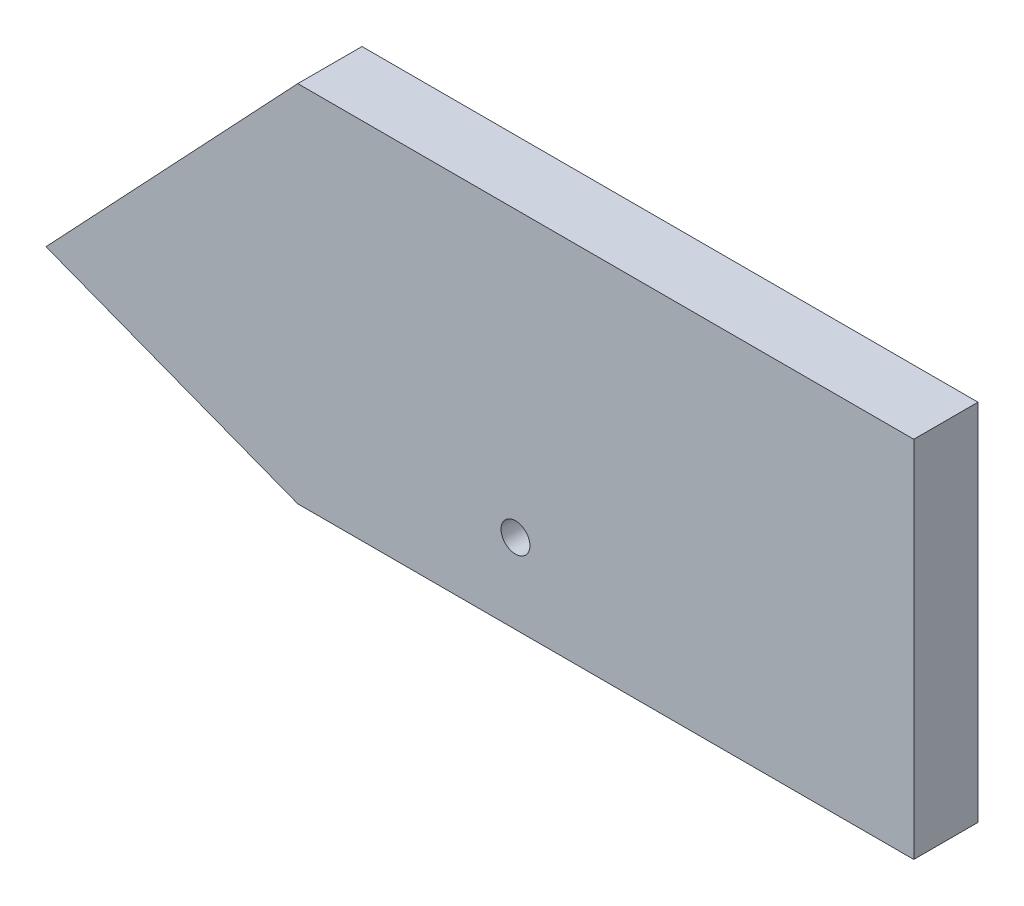
ISO-10303-21;
HEADER;
FILE_DESCRIPTION(('STEP AP214'),'2;1');
FILE_NAME('part.step','',(''),(''),'','','');
FILE_SCHEMA(('AUTOMOTIVE_DESIGN { 1 0 10303 214 1 1 1 1 }'));
ENDSEC;
DATA;
#1=APPLICATION_CONTEXT('core data for automotive mechanical design processes');
#2=APPLICATION_PROTOCOL_DEFINITION('international standard','automotive_design',2000,#1);
#3=PRODUCT_CONTEXT('',#1,'mechanical');
#4=PRODUCT('Part','Part','',(#3));
#5=PRODUCT_RELATED_PRODUCT_CATEGORY('part','',(#4));
#6=PRODUCT_DEFINITION_FORMATION('','',#4);
#7=PRODUCT_DEFINITION_CONTEXT('part definition',#1,'design');
#8=PRODUCT_DEFINITION('design','',#6,#7);
#9=PRODUCT_DEFINITION_SHAPE('','',#8);
#10=(LENGTH_UNIT() NAMED_UNIT(*) SI_UNIT(.MILLI.,.METRE.));
#11=(NAMED_UNIT(*) PLANE_ANGLE_UNIT() SI_UNIT($,.RADIAN.));
#12=(NAMED_UNIT(*) SI_UNIT($,.STERADIAN.) SOLID_ANGLE_UNIT());
#13=UNCERTAINTY_MEASURE_WITH_UNIT(LENGTH_MEASURE(1.E-05),#10,'distance_accuracy_value','');
#14=(GEOMETRIC_REPRESENTATION_CONTEXT(3) GLOBAL_UNCERTAINTY_ASSIGNED_CONTEXT((#13)) GLOBAL_UNIT_ASSIGNED_CONTEXT((#10,
#11,#12)) REPRESENTATION_CONTEXT('',''));
#15=CARTESIAN_POINT('',(0.,0.,0.));
#16=DIRECTION('',(0.,0.,1.));
#17=DIRECTION('',(1.,0.,0.));
#18=AXIS2_PLACEMENT_3D('',#15,#16,#17);
#19=CARTESIAN_POINT('',(-460.979412648812,-194.929034047607,10.));
#20=DIRECTION('',(-1.,0.,0.));
#21=DIRECTION('',(0.,0.,1.));
#22=AXIS2_PLACEMENT_3D('',#19,#20,#21);
#23=PLANE('',#22);
#24=DIRECTION('',(0.,1.,0.));
#25=VECTOR('',#24,1.);
#26=CARTESIAN_POINT('',(-460.979412648812,-194.929034047607,0.));
#27=LINE('',#26,#25);
#28=CARTESIAN_POINT('',(-460.979412648812,-194.929034047607,0.));
#29=VERTEX_POINT('',#28);
#30=CARTESIAN_POINT('',(-460.979412648812,-138.268279633482,0.));
#31=VERTEX_POINT('',#30);
#32=EDGE_CURVE('E109',#29,#31,#27,.T.);
#33=ORIENTED_EDGE('',*,*,#32,.T.);
#34=DIRECTION('',(0.,0.,-1.));
#35=VECTOR('',#34,1.);
#36=CARTESIAN_POINT('',(-460.979412648812,-138.268279633482,10.));
#37=LINE('',#36,#35);
#38=CARTESIAN_POINT('',(-460.979412648812,-138.268279633482,10.));
#39=VERTEX_POINT('',#38);
#40=EDGE_CURVE('E11',#39,#31,#37,.T.);
#41=ORIENTED_EDGE('',*,*,#40,.F.);
#42=DIRECTION('',(0.,1.,0.));
#43=VECTOR('',#42,1.);
#44=CARTESIAN_POINT('',(-460.979412648812,-194.929034047607,10.));
#45=LINE('',#44,#43);
#46=CARTESIAN_POINT('',(-460.979412648812,-194.929034047607,10.));
#47=VERTEX_POINT('',#46);
#48=EDGE_CURVE('E118',#47,#39,#45,.T.);
#49=ORIENTED_EDGE('',*,*,#48,.F.);
#50=DIRECTION('',(0.,0.,-1.));
#51=VECTOR('',#50,1.);
#52=CARTESIAN_POINT('',(-460.979412648812,-194.929034047607,10.));
#53=LINE('',#52,#51);
#54=EDGE_CURVE('E105',#47,#29,#53,.T.);
#55=ORIENTED_EDGE('',*,*,#54,.T.);
#56=EDGE_LOOP('',(#33,#41,#49,#55));
#57=FACE_BOUND('',#56,.T.);
#58=ADVANCED_FACE('F35',(#57),#23,.F.);
#59=CARTESIAN_POINT('',(-460.979412648812,-138.268279633482,10.));
#60=DIRECTION('',(0.,-1.,0.));
#61=DIRECTION('',(0.,0.,-1.));
#62=AXIS2_PLACEMENT_3D('',#59,#60,#61);
#63=PLANE('',#62);
#64=DIRECTION('',(-1.,0.,0.));
#65=VECTOR('',#64,1.);
#66=CARTESIAN_POINT('',(-460.979412648812,-138.268279633482,0.));
#67=LINE('',#66,#65);
#68=CARTESIAN_POINT('',(-556.886836404831,-138.268279633482,0.));
#69=VERTEX_POINT('',#68);
#70=EDGE_CURVE('E112',#31,#69,#67,.T.);
#71=ORIENTED_EDGE('',*,*,#70,.T.);
#72=DIRECTION('',(0.,0.,-1.));
#73=VECTOR('',#72,1.);
#74=CARTESIAN_POINT('',(-556.886836404831,-138.268279633482,10.));
#75=LINE('',#74,#73);
#76=CARTESIAN_POINT('',(-556.886836404831,-138.268279633482,10.));
#77=VERTEX_POINT('',#76);
#78=EDGE_CURVE('E43',#77,#69,#75,.T.);
#79=ORIENTED_EDGE('',*,*,#78,.F.);
#80=DIRECTION('',(-1.,0.,0.));
#81=VECTOR('',#80,1.);
#82=CARTESIAN_POINT('',(-460.979412648812,-138.268279633482,10.));
#83=LINE('',#82,#81);
#84=EDGE_CURVE('E85',#39,#77,#83,.T.);
#85=ORIENTED_EDGE('',*,*,#84,.F.);
#86=ORIENTED_EDGE('',*,*,#40,.T.);
#87=EDGE_LOOP('',(#71,#79,#85,#86));
#88=FACE_BOUND('',#87,.T.);
#89=ADVANCED_FACE('F138',(#88),#63,.F.);
#90=CARTESIAN_POINT('',(-556.886836404831,-138.268279633482,10.));
#91=DIRECTION('',(0.727697954606059,-0.68589772332481,0.));
#92=DIRECTION('',(0.68589772332481,0.727697954606059,0.));
#93=AXIS2_PLACEMENT_3D('',#90,#91,#92);
#94=PLANE('',#93);
#95=DIRECTION('',(-0.68589772332481,-0.727697954606059,0.));
#96=VECTOR('',#95,1.);
#97=CARTESIAN_POINT('',(-556.886836404831,-138.268279633482,0.));
#98=LINE('',#97,#96);
#99=CARTESIAN_POINT('',(-596.082218436845,-179.852321050678,0.));
#100=VERTEX_POINT('',#99);
#101=EDGE_CURVE('E100',#69,#100,#98,.T.);
#102=ORIENTED_EDGE('',*,*,#101,.T.);
#103=DIRECTION('',(0.,0.,-1.));
#104=VECTOR('',#103,1.);
#105=CARTESIAN_POINT('',(-596.082218436845,-179.852321050678,10.));
#106=LINE('',#105,#104);
#107=CARTESIAN_POINT('',(-596.082218436845,-179.852321050678,10.));
#108=VERTEX_POINT('',#107);
#109=EDGE_CURVE('E97',#108,#100,#106,.T.);
#110=ORIENTED_EDGE('',*,*,#109,.F.);
#111=DIRECTION('',(-0.68589772332481,-0.727697954606059,0.));
#112=VECTOR('',#111,1.);
#113=CARTESIAN_POINT('',(-556.886836404831,-138.268279633482,10.));
#114=LINE('',#113,#112);
#115=EDGE_CURVE('E89',#77,#108,#114,.T.);
#116=ORIENTED_EDGE('',*,*,#115,.F.);
#117=ORIENTED_EDGE('',*,*,#78,.T.);
#118=EDGE_LOOP('',(#102,#110,#116,#117));
#119=FACE_BOUND('',#118,.T.);
#120=ADVANCED_FACE('F98',(#119),#94,.F.);
#121=CARTESIAN_POINT('',(-596.082218436845,-179.852321050678,10.));
#122=DIRECTION('',(0.359011565041303,0.933333111041601,0.));
#123=DIRECTION('',(-0.933333111041601,0.359011565041303,0.));
#124=AXIS2_PLACEMENT_3D('',#121,#122,#123);
#125=PLANE('',#124);
#126=DIRECTION('',(0.933333111041601,-0.359011565041303,0.));
#127=VECTOR('',#126,1.);
#128=CARTESIAN_POINT('',(-596.082218436845,-179.852321050678,0.));
#129=LINE('',#128,#127);
#130=CARTESIAN_POINT('',(-556.886836404831,-194.929034047607,0.));
#131=VERTEX_POINT('',#130);
#132=EDGE_CURVE('E71',#100,#131,#129,.T.);
#133=ORIENTED_EDGE('',*,*,#132,.T.);
#134=DIRECTION('',(0.,0.,-1.));
#135=VECTOR('',#134,1.);
#136=CARTESIAN_POINT('',(-556.886836404831,-194.929034047607,10.));
#137=LINE('',#136,#135);
#138=CARTESIAN_POINT('',(-556.886836404831,-194.929034047607,10.));
#139=VERTEX_POINT('',#138);
#140=EDGE_CURVE('E101',#139,#131,#137,.T.);
#141=ORIENTED_EDGE('',*,*,#140,.F.);
#142=DIRECTION('',(0.933333111041601,-0.359011565041303,0.));
#143=VECTOR('',#142,1.);
#144=CARTESIAN_POINT('',(-596.082218436845,-179.852321050678,10.));
#145=LINE('',#144,#143);
#146=EDGE_CURVE('E93',#108,#139,#145,.T.);
#147=ORIENTED_EDGE('',*,*,#146,.F.);
#148=ORIENTED_EDGE('',*,*,#109,.T.);
#149=EDGE_LOOP('',(#133,#141,#147,#148));
#150=FACE_BOUND('',#149,.T.);
#151=ADVANCED_FACE('F103',(#150),#125,.F.);
#152=CARTESIAN_POINT('',(-556.886836404831,-194.929034047607,10.));
#153=DIRECTION('',(0.,1.,0.));
#154=DIRECTION('',(0.,0.,1.));
#155=AXIS2_PLACEMENT_3D('',#152,#153,#154);
#156=PLANE('',#155);
#157=DIRECTION('',(1.,0.,0.));
#158=VECTOR('',#157,1.);
#159=CARTESIAN_POINT('',(-556.886836404831,-194.929034047607,0.));
#160=LINE('',#159,#158);
#161=EDGE_CURVE('E77',#131,#29,#160,.T.);
#162=ORIENTED_EDGE('',*,*,#161,.T.);
#163=ORIENTED_EDGE('',*,*,#54,.F.);
#164=DIRECTION('',(1.,0.,0.));
#165=VECTOR('',#164,1.);
#166=CARTESIAN_POINT('',(-556.886836404831,-194.929034047607,10.));
#167=LINE('',#166,#165);
#168=EDGE_CURVE('E51',#139,#47,#167,.T.);
#169=ORIENTED_EDGE('',*,*,#168,.F.);
#170=ORIENTED_EDGE('',*,*,#140,.T.);
#171=EDGE_LOOP('',(#162,#163,#169,#170));
#172=FACE_BOUND('',#171,.T.);
#173=ADVANCED_FACE('F126',(#172),#156,.F.);
#174=CARTESIAN_POINT('',(0.,0.,10.));
#175=DIRECTION('',(0.,0.,1.));
#176=DIRECTION('',(1.,0.,0.));
#177=AXIS2_PLACEMENT_3D('',#174,#175,#176);
#178=PLANE('',#177);
#179=CARTESIAN_POINT('',(-522.988022528788,-182.510884741862,10.));
#180=DIRECTION('',(0.,0.,1.));
#181=DIRECTION('',(1.,0.,0.));
#182=AXIS2_PLACEMENT_3D('',#179,#180,#181);
#183=CIRCLE('',#182,2.24999999999997);
#184=CARTESIAN_POINT('',(-520.738022528788,-182.510884741862,10.));
#185=VERTEX_POINT('',#184);
#186=EDGE_CURVE('E189',#185,#185,#183,.T.);
#187=ORIENTED_EDGE('',*,*,#186,.F.);
#188=EDGE_LOOP('',(#187));
#189=FACE_BOUND('',#188,.T.);
#190=ORIENTED_EDGE('',*,*,#48,.T.);
#191=ORIENTED_EDGE('',*,*,#84,.T.);
#192=ORIENTED_EDGE('',*,*,#115,.T.);
#193=ORIENTED_EDGE('',*,*,#146,.T.);
#194=ORIENTED_EDGE('',*,*,#168,.T.);
#195=EDGE_LOOP('',(#190,#191,#192,#193,#194));
#196=FACE_BOUND('',#195,.T.);
#197=ADVANCED_FACE('F91',(#189,#196),#178,.T.);
#198=CARTESIAN_POINT('',(0.,0.,0.));
#199=DIRECTION('',(0.,0.,1.));
#200=DIRECTION('',(1.,0.,0.));
#201=AXIS2_PLACEMENT_3D('',#198,#199,#200);
#202=PLANE('',#201);
#203=CARTESIAN_POINT('',(-522.988022528788,-182.510884741862,0.));
#204=DIRECTION('',(0.,0.,1.));
#205=DIRECTION('',(1.,0.,0.));
#206=AXIS2_PLACEMENT_3D('',#203,#204,#205);
#207=CIRCLE('',#206,2.24999999999997);
#208=CARTESIAN_POINT('',(-520.738022528788,-182.510884741862,0.));
#209=VERTEX_POINT('',#208);
#210=EDGE_CURVE('E113',#209,#209,#207,.T.);
#211=ORIENTED_EDGE('',*,*,#210,.T.);
#212=EDGE_LOOP('',(#211));
#213=FACE_BOUND('',#212,.T.);
#214=ORIENTED_EDGE('',*,*,#32,.F.);
#215=ORIENTED_EDGE('',*,*,#161,.F.);
#216=ORIENTED_EDGE('',*,*,#132,.F.);
#217=ORIENTED_EDGE('',*,*,#101,.F.);
#218=ORIENTED_EDGE('',*,*,#70,.F.);
#219=EDGE_LOOP('',(#214,#215,#216,#217,#218));
#220=FACE_BOUND('',#219,.T.);
#221=ADVANCED_FACE('F122',(#213,#220),#202,.F.);
#222=CARTESIAN_POINT('',(-522.988022528788,-182.510884741862,10.));
#223=DIRECTION('',(0.,0.,1.));
#224=DIRECTION('',(1.,0.,0.));
#225=AXIS2_PLACEMENT_3D('',#222,#223,#224);
#226=CYLINDRICAL_SURFACE('',#225,2.24999999999997);
#227=ORIENTED_EDGE('',*,*,#210,.F.);
#228=EDGE_LOOP('',(#227));
#229=FACE_BOUND('',#228,.T.);
#230=ORIENTED_EDGE('',*,*,#186,.T.);
#231=EDGE_LOOP('',(#230));
#232=FACE_BOUND('',#231,.T.);
#233=ADVANCED_FACE('F171',(#229,#232),#226,.F.);
#234=CLOSED_SHELL('',(#58,#89,#120,#151,#173,#197,#221,#233));
#235=MANIFOLD_SOLID_BREP('B2',#234);
#236=ADVANCED_BREP_SHAPE_REPRESENTATION('',(#18,#235),#14);
#237=SHAPE_DEFINITION_REPRESENTATION(#9,#236);
ENDSEC;
END-ISO-10303-21;
